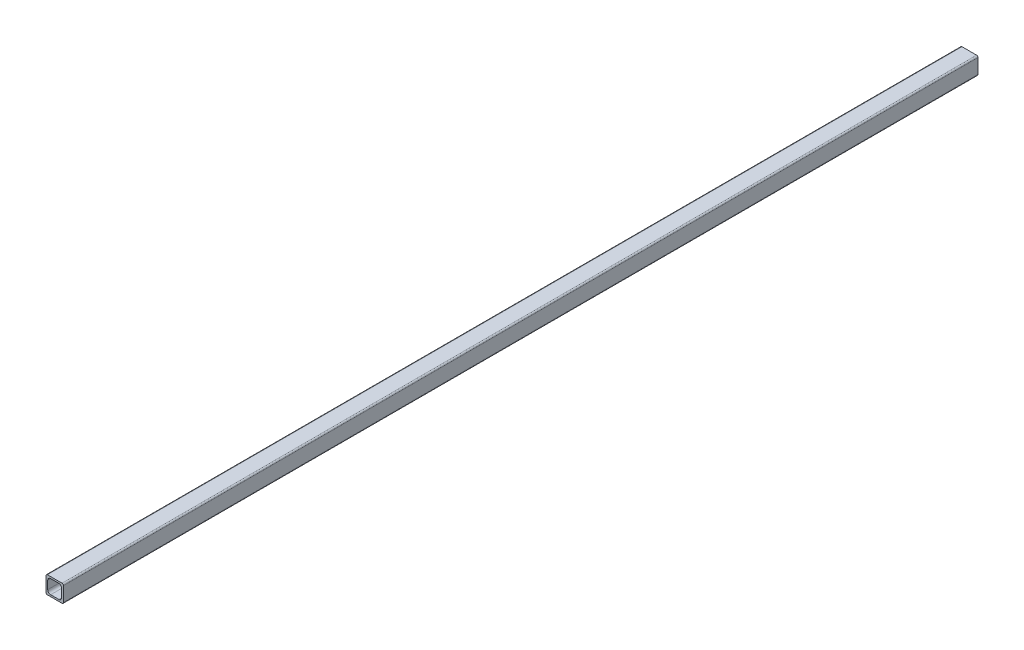
ISO-10303-21;
HEADER;
FILE_DESCRIPTION(('STEP AP214'),'2;1');
FILE_NAME('part.step','',(''),(''),'','','');
FILE_SCHEMA(('AUTOMOTIVE_DESIGN { 1 0 10303 214 1 1 1 1 }'));
ENDSEC;
DATA;
#1=APPLICATION_CONTEXT('core data for automotive mechanical design processes');
#2=APPLICATION_PROTOCOL_DEFINITION('international standard','automotive_design',2000,#1);
#3=PRODUCT_CONTEXT('',#1,'mechanical');
#4=PRODUCT('Part','Part','',(#3));
#5=PRODUCT_RELATED_PRODUCT_CATEGORY('part','',(#4));
#6=PRODUCT_DEFINITION_FORMATION('','',#4);
#7=PRODUCT_DEFINITION_CONTEXT('part definition',#1,'design');
#8=PRODUCT_DEFINITION('design','',#6,#7);
#9=PRODUCT_DEFINITION_SHAPE('','',#8);
#10=(LENGTH_UNIT() NAMED_UNIT(*) SI_UNIT(.MILLI.,.METRE.));
#11=(NAMED_UNIT(*) PLANE_ANGLE_UNIT() SI_UNIT($,.RADIAN.));
#12=(NAMED_UNIT(*) SI_UNIT($,.STERADIAN.) SOLID_ANGLE_UNIT());
#13=UNCERTAINTY_MEASURE_WITH_UNIT(LENGTH_MEASURE(1.E-05),#10,'distance_accuracy_value','');
#14=(GEOMETRIC_REPRESENTATION_CONTEXT(3) GLOBAL_UNCERTAINTY_ASSIGNED_CONTEXT((#13)) GLOBAL_UNIT_ASSIGNED_CONTEXT((#10,
#11,#12)) REPRESENTATION_CONTEXT('',''));
#15=CARTESIAN_POINT('',(0.,0.,0.));
#16=DIRECTION('',(0.,0.,1.));
#17=DIRECTION('',(1.,0.,0.));
#18=AXIS2_PLACEMENT_3D('',#15,#16,#17);
#19=CARTESIAN_POINT('',(1.524,1.524,-1000.125));
#20=DIRECTION('',(0.,0.,1.));
#21=DIRECTION('',(1.,0.,0.));
#22=AXIS2_PLACEMENT_3D('',#19,#20,#21);
#23=CYLINDRICAL_SURFACE('',#22,1.524);
#24=CARTESIAN_POINT('',(1.524,1.524,0.));
#25=DIRECTION('',(0.,0.,1.));
#26=DIRECTION('',(1.,0.,0.));
#27=AXIS2_PLACEMENT_3D('',#24,#25,#26);
#28=CIRCLE('',#27,1.524);
#29=CARTESIAN_POINT('',(0.,1.52400000000001,0.));
#30=VERTEX_POINT('',#29);
#31=CARTESIAN_POINT('',(1.52400000000001,0.,0.));
#32=VERTEX_POINT('',#31);
#33=EDGE_CURVE('E213',#30,#32,#28,.T.);
#34=ORIENTED_EDGE('',*,*,#33,.F.);
#35=DIRECTION('',(0.,0.,1.));
#36=VECTOR('',#35,1.);
#37=CARTESIAN_POINT('',(0.,1.52400000000001,-1000.125));
#38=LINE('',#37,#36);
#39=CARTESIAN_POINT('',(0.,1.52400000000001,-1000.125));
#40=VERTEX_POINT('',#39);
#41=EDGE_CURVE('E11',#40,#30,#38,.T.);
#42=ORIENTED_EDGE('',*,*,#41,.F.);
#43=CARTESIAN_POINT('',(1.524,1.524,-1000.125));
#44=DIRECTION('',(0.,0.,1.));
#45=DIRECTION('',(1.,0.,0.));
#46=AXIS2_PLACEMENT_3D('',#43,#44,#45);
#47=CIRCLE('',#46,1.524);
#48=CARTESIAN_POINT('',(1.52400000000001,0.,-1000.125));
#49=VERTEX_POINT('',#48);
#50=EDGE_CURVE('E225',#40,#49,#47,.T.);
#51=ORIENTED_EDGE('',*,*,#50,.T.);
#52=DIRECTION('',(0.,0.,1.));
#53=VECTOR('',#52,1.);
#54=CARTESIAN_POINT('',(1.52400000000001,0.,-1000.125));
#55=LINE('',#54,#53);
#56=EDGE_CURVE('E46',#49,#32,#55,.T.);
#57=ORIENTED_EDGE('',*,*,#56,.T.);
#58=EDGE_LOOP('',(#34,#42,#51,#57));
#59=FACE_BOUND('',#58,.T.);
#60=ADVANCED_FACE('F43',(#59),#23,.T.);
#61=CARTESIAN_POINT('',(0.,1.52400000000001,-1000.125));
#62=DIRECTION('',(-1.,0.,0.));
#63=DIRECTION('',(0.,0.,1.));
#64=AXIS2_PLACEMENT_3D('',#61,#62,#63);
#65=PLANE('',#64);
#66=DIRECTION('',(0.,-1.,0.));
#67=VECTOR('',#66,1.);
#68=CARTESIAN_POINT('',(0.,1.52400000000001,0.));
#69=LINE('',#68,#67);
#70=CARTESIAN_POINT('',(0.,17.526,0.));
#71=VERTEX_POINT('',#70);
#72=EDGE_CURVE('E229',#71,#30,#69,.T.);
#73=ORIENTED_EDGE('',*,*,#72,.F.);
#74=DIRECTION('',(0.,0.,1.));
#75=VECTOR('',#74,1.);
#76=CARTESIAN_POINT('',(0.,17.526,-1000.125));
#77=LINE('',#76,#75);
#78=CARTESIAN_POINT('',(0.,17.526,-1000.125));
#79=VERTEX_POINT('',#78);
#80=EDGE_CURVE('E51',#79,#71,#77,.T.);
#81=ORIENTED_EDGE('',*,*,#80,.F.);
#82=DIRECTION('',(0.,-1.,0.));
#83=VECTOR('',#82,1.);
#84=CARTESIAN_POINT('',(0.,1.52400000000001,-1000.125));
#85=LINE('',#84,#83);
#86=EDGE_CURVE('E247',#79,#40,#85,.T.);
#87=ORIENTED_EDGE('',*,*,#86,.T.);
#88=ORIENTED_EDGE('',*,*,#41,.T.);
#89=EDGE_LOOP('',(#73,#81,#87,#88));
#90=FACE_BOUND('',#89,.T.);
#91=ADVANCED_FACE('F294',(#90),#65,.T.);
#92=CARTESIAN_POINT('',(1.524,17.526,-1000.125));
#93=DIRECTION('',(0.,0.,1.));
#94=DIRECTION('',(1.,0.,0.));
#95=AXIS2_PLACEMENT_3D('',#92,#93,#94);
#96=CYLINDRICAL_SURFACE('',#95,1.524);
#97=CARTESIAN_POINT('',(1.524,17.526,0.));
#98=DIRECTION('',(0.,0.,1.));
#99=DIRECTION('',(-1.,0.,0.));
#100=AXIS2_PLACEMENT_3D('',#97,#98,#99);
#101=CIRCLE('',#100,1.524);
#102=CARTESIAN_POINT('',(1.52400000000001,19.05,0.));
#103=VERTEX_POINT('',#102);
#104=EDGE_CURVE('E267',#103,#71,#101,.T.);
#105=ORIENTED_EDGE('',*,*,#104,.F.);
#106=DIRECTION('',(0.,0.,1.));
#107=VECTOR('',#106,1.);
#108=CARTESIAN_POINT('',(1.52400000000001,19.05,-1000.125));
#109=LINE('',#108,#107);
#110=CARTESIAN_POINT('',(1.52400000000001,19.05,-1000.125));
#111=VERTEX_POINT('',#110);
#112=EDGE_CURVE('E273',#111,#103,#109,.T.);
#113=ORIENTED_EDGE('',*,*,#112,.F.);
#114=CARTESIAN_POINT('',(1.524,17.526,-1000.125));
#115=DIRECTION('',(0.,0.,1.));
#116=DIRECTION('',(-1.,0.,0.));
#117=AXIS2_PLACEMENT_3D('',#114,#115,#116);
#118=CIRCLE('',#117,1.524);
#119=EDGE_CURVE('E244',#111,#79,#118,.T.);
#120=ORIENTED_EDGE('',*,*,#119,.T.);
#121=ORIENTED_EDGE('',*,*,#80,.T.);
#122=EDGE_LOOP('',(#105,#113,#120,#121));
#123=FACE_BOUND('',#122,.T.);
#124=ADVANCED_FACE('F313',(#123),#96,.T.);
#125=CARTESIAN_POINT('',(1.52400000000001,19.05,-1000.125));
#126=DIRECTION('',(0.,1.,0.));
#127=DIRECTION('',(0.,0.,1.));
#128=AXIS2_PLACEMENT_3D('',#125,#126,#127);
#129=PLANE('',#128);
#130=DIRECTION('',(-1.,0.,0.));
#131=VECTOR('',#130,1.);
#132=CARTESIAN_POINT('',(1.52400000000001,19.05,0.));
#133=LINE('',#132,#131);
#134=CARTESIAN_POINT('',(17.526,19.05,0.));
#135=VERTEX_POINT('',#134);
#136=EDGE_CURVE('E264',#135,#103,#133,.T.);
#137=ORIENTED_EDGE('',*,*,#136,.F.);
#138=DIRECTION('',(0.,0.,1.));
#139=VECTOR('',#138,1.);
#140=CARTESIAN_POINT('',(17.526,19.05,-1000.125));
#141=LINE('',#140,#139);
#142=CARTESIAN_POINT('',(17.526,19.05,-1000.125));
#143=VERTEX_POINT('',#142);
#144=EDGE_CURVE('E275',#143,#135,#141,.T.);
#145=ORIENTED_EDGE('',*,*,#144,.F.);
#146=DIRECTION('',(-1.,0.,0.));
#147=VECTOR('',#146,1.);
#148=CARTESIAN_POINT('',(1.52400000000001,19.05,-1000.125));
#149=LINE('',#148,#147);
#150=EDGE_CURVE('E241',#143,#111,#149,.T.);
#151=ORIENTED_EDGE('',*,*,#150,.T.);
#152=ORIENTED_EDGE('',*,*,#112,.T.);
#153=EDGE_LOOP('',(#137,#145,#151,#152));
#154=FACE_BOUND('',#153,.T.);
#155=ADVANCED_FACE('F311',(#154),#129,.T.);
#156=CARTESIAN_POINT('',(17.526,17.526,-1000.125));
#157=DIRECTION('',(0.,0.,1.));
#158=DIRECTION('',(1.,0.,0.));
#159=AXIS2_PLACEMENT_3D('',#156,#157,#158);
#160=CYLINDRICAL_SURFACE('',#159,1.524);
#161=CARTESIAN_POINT('',(17.526,17.526,0.));
#162=DIRECTION('',(0.,0.,1.));
#163=DIRECTION('',(1.,0.,0.));
#164=AXIS2_PLACEMENT_3D('',#161,#162,#163);
#165=CIRCLE('',#164,1.524);
#166=CARTESIAN_POINT('',(19.05,17.526,0.));
#167=VERTEX_POINT('',#166);
#168=EDGE_CURVE('E261',#167,#135,#165,.T.);
#169=ORIENTED_EDGE('',*,*,#168,.F.);
#170=DIRECTION('',(0.,0.,1.));
#171=VECTOR('',#170,1.);
#172=CARTESIAN_POINT('',(19.05,17.526,-1000.125));
#173=LINE('',#172,#171);
#174=CARTESIAN_POINT('',(19.05,17.526,-1000.125));
#175=VERTEX_POINT('',#174);
#176=EDGE_CURVE('E277',#175,#167,#173,.T.);
#177=ORIENTED_EDGE('',*,*,#176,.F.);
#178=CARTESIAN_POINT('',(17.526,17.526,-1000.125));
#179=DIRECTION('',(0.,0.,1.));
#180=DIRECTION('',(1.,0.,0.));
#181=AXIS2_PLACEMENT_3D('',#178,#179,#180);
#182=CIRCLE('',#181,1.524);
#183=EDGE_CURVE('E238',#175,#143,#182,.T.);
#184=ORIENTED_EDGE('',*,*,#183,.T.);
#185=ORIENTED_EDGE('',*,*,#144,.T.);
#186=EDGE_LOOP('',(#169,#177,#184,#185));
#187=FACE_BOUND('',#186,.T.);
#188=ADVANCED_FACE('F307',(#187),#160,.T.);
#189=CARTESIAN_POINT('',(19.05,1.52400000000001,-1000.125));
#190=DIRECTION('',(1.,0.,0.));
#191=DIRECTION('',(0.,0.,-1.));
#192=AXIS2_PLACEMENT_3D('',#189,#190,#191);
#193=PLANE('',#192);
#194=DIRECTION('',(0.,1.,0.));
#195=VECTOR('',#194,1.);
#196=CARTESIAN_POINT('',(19.05,1.52400000000001,0.));
#197=LINE('',#196,#195);
#198=CARTESIAN_POINT('',(19.05,1.52400000000001,0.));
#199=VERTEX_POINT('',#198);
#200=EDGE_CURVE('E258',#199,#167,#197,.T.);
#201=ORIENTED_EDGE('',*,*,#200,.F.);
#202=DIRECTION('',(0.,0.,1.));
#203=VECTOR('',#202,1.);
#204=CARTESIAN_POINT('',(19.05,1.52400000000001,-1000.125));
#205=LINE('',#204,#203);
#206=CARTESIAN_POINT('',(19.05,1.52400000000001,-1000.125));
#207=VERTEX_POINT('',#206);
#208=EDGE_CURVE('E279',#207,#199,#205,.T.);
#209=ORIENTED_EDGE('',*,*,#208,.F.);
#210=DIRECTION('',(0.,1.,0.));
#211=VECTOR('',#210,1.);
#212=CARTESIAN_POINT('',(19.05,1.52400000000001,-1000.125));
#213=LINE('',#212,#211);
#214=EDGE_CURVE('E235',#207,#175,#213,.T.);
#215=ORIENTED_EDGE('',*,*,#214,.T.);
#216=ORIENTED_EDGE('',*,*,#176,.T.);
#217=EDGE_LOOP('',(#201,#209,#215,#216));
#218=FACE_BOUND('',#217,.T.);
#219=ADVANCED_FACE('F305',(#218),#193,.T.);
#220=CARTESIAN_POINT('',(17.526,1.524,-1000.125));
#221=DIRECTION('',(0.,0.,1.));
#222=DIRECTION('',(1.,0.,0.));
#223=AXIS2_PLACEMENT_3D('',#220,#221,#222);
#224=CYLINDRICAL_SURFACE('',#223,1.524);
#225=CARTESIAN_POINT('',(17.526,1.524,0.));
#226=DIRECTION('',(0.,0.,1.));
#227=DIRECTION('',(1.,0.,0.));
#228=AXIS2_PLACEMENT_3D('',#225,#226,#227);
#229=CIRCLE('',#228,1.524);
#230=CARTESIAN_POINT('',(17.526,0.,0.));
#231=VERTEX_POINT('',#230);
#232=EDGE_CURVE('E255',#231,#199,#229,.T.);
#233=ORIENTED_EDGE('',*,*,#232,.F.);
#234=DIRECTION('',(0.,0.,1.));
#235=VECTOR('',#234,1.);
#236=CARTESIAN_POINT('',(17.526,0.,-1000.125));
#237=LINE('',#236,#235);
#238=CARTESIAN_POINT('',(17.526,0.,-1000.125));
#239=VERTEX_POINT('',#238);
#240=EDGE_CURVE('E280',#239,#231,#237,.T.);
#241=ORIENTED_EDGE('',*,*,#240,.F.);
#242=CARTESIAN_POINT('',(17.526,1.524,-1000.125));
#243=DIRECTION('',(0.,0.,1.));
#244=DIRECTION('',(1.,0.,0.));
#245=AXIS2_PLACEMENT_3D('',#242,#243,#244);
#246=CIRCLE('',#245,1.524);
#247=EDGE_CURVE('E232',#239,#207,#246,.T.);
#248=ORIENTED_EDGE('',*,*,#247,.T.);
#249=ORIENTED_EDGE('',*,*,#208,.T.);
#250=EDGE_LOOP('',(#233,#241,#248,#249));
#251=FACE_BOUND('',#250,.T.);
#252=ADVANCED_FACE('F301',(#251),#224,.T.);
#253=CARTESIAN_POINT('',(1.52400000000001,0.,-1000.125));
#254=DIRECTION('',(0.,-1.,0.));
#255=DIRECTION('',(0.,0.,-1.));
#256=AXIS2_PLACEMENT_3D('',#253,#254,#255);
#257=PLANE('',#256);
#258=DIRECTION('',(1.,0.,0.));
#259=VECTOR('',#258,1.);
#260=CARTESIAN_POINT('',(1.52400000000001,0.,0.));
#261=LINE('',#260,#259);
#262=EDGE_CURVE('E252',#32,#231,#261,.T.);
#263=ORIENTED_EDGE('',*,*,#262,.F.);
#264=ORIENTED_EDGE('',*,*,#56,.F.);
#265=DIRECTION('',(1.,0.,0.));
#266=VECTOR('',#265,1.);
#267=CARTESIAN_POINT('',(1.52400000000001,0.,-1000.125));
#268=LINE('',#267,#266);
#269=EDGE_CURVE('E228',#49,#239,#268,.T.);
#270=ORIENTED_EDGE('',*,*,#269,.T.);
#271=ORIENTED_EDGE('',*,*,#240,.T.);
#272=EDGE_LOOP('',(#263,#264,#270,#271));
#273=FACE_BOUND('',#272,.T.);
#274=ADVANCED_FACE('F288',(#273),#257,.T.);
#275=CARTESIAN_POINT('',(1.524,1.524,-1000.125));
#276=DIRECTION('',(0.,0.,1.));
#277=DIRECTION('',(1.,0.,0.));
#278=AXIS2_PLACEMENT_3D('',#275,#276,#277);
#279=PLANE('',#278);
#280=DIRECTION('',(0.,1.,0.));
#281=VECTOR('',#280,1.);
#282=CARTESIAN_POINT('',(17.145,13.97,-1000.125));
#283=LINE('',#282,#281);
#284=CARTESIAN_POINT('',(17.145,5.08000000000002,-1000.125));
#285=VERTEX_POINT('',#284);
#286=CARTESIAN_POINT('',(17.145,13.97,-1000.125));
#287=VERTEX_POINT('',#286);
#288=EDGE_CURVE('E164',#285,#287,#283,.T.);
#289=ORIENTED_EDGE('',*,*,#288,.T.);
#290=CARTESIAN_POINT('',(13.97,13.97,-1000.125));
#291=DIRECTION('',(0.,0.,1.));
#292=DIRECTION('',(-1.,0.,0.));
#293=AXIS2_PLACEMENT_3D('',#290,#291,#292);
#294=CIRCLE('',#293,3.175);
#295=CARTESIAN_POINT('',(13.97,17.145,-1000.125));
#296=VERTEX_POINT('',#295);
#297=EDGE_CURVE('E158',#287,#296,#294,.T.);
#298=ORIENTED_EDGE('',*,*,#297,.T.);
#299=DIRECTION('',(-1.,0.,0.));
#300=VECTOR('',#299,1.);
#301=CARTESIAN_POINT('',(5.08000000000003,17.145,-1000.125));
#302=LINE('',#301,#300);
#303=CARTESIAN_POINT('',(5.08000000000003,17.145,-1000.125));
#304=VERTEX_POINT('',#303);
#305=EDGE_CURVE('E167',#296,#304,#302,.T.);
#306=ORIENTED_EDGE('',*,*,#305,.T.);
#307=CARTESIAN_POINT('',(5.08000000000001,13.97,-1000.125));
#308=DIRECTION('',(0.,0.,1.));
#309=DIRECTION('',(-1.,0.,0.));
#310=AXIS2_PLACEMENT_3D('',#307,#308,#309);
#311=CIRCLE('',#310,3.175);
#312=CARTESIAN_POINT('',(1.90500000000001,13.97,-1000.125));
#313=VERTEX_POINT('',#312);
#314=EDGE_CURVE('E59',#304,#313,#311,.T.);
#315=ORIENTED_EDGE('',*,*,#314,.T.);
#316=DIRECTION('',(0.,-1.,0.));
#317=VECTOR('',#316,1.);
#318=CARTESIAN_POINT('',(1.90500000000001,13.97,-1000.125));
#319=LINE('',#318,#317);
#320=CARTESIAN_POINT('',(1.90500000000001,5.08000000000002,-1000.125));
#321=VERTEX_POINT('',#320);
#322=EDGE_CURVE('E182',#313,#321,#319,.T.);
#323=ORIENTED_EDGE('',*,*,#322,.T.);
#324=CARTESIAN_POINT('',(5.08000000000001,5.08,-1000.125));
#325=DIRECTION('',(0.,0.,1.));
#326=DIRECTION('',(-1.,0.,0.));
#327=AXIS2_PLACEMENT_3D('',#324,#325,#326);
#328=CIRCLE('',#327,3.175);
#329=CARTESIAN_POINT('',(5.08000000000003,1.905,-1000.125));
#330=VERTEX_POINT('',#329);
#331=EDGE_CURVE('E185',#321,#330,#328,.T.);
#332=ORIENTED_EDGE('',*,*,#331,.T.);
#333=DIRECTION('',(1.,0.,0.));
#334=VECTOR('',#333,1.);
#335=CARTESIAN_POINT('',(5.08000000000003,1.905,-1000.125));
#336=LINE('',#335,#334);
#337=CARTESIAN_POINT('',(13.97,1.905,-1000.125));
#338=VERTEX_POINT('',#337);
#339=EDGE_CURVE('E188',#330,#338,#336,.T.);
#340=ORIENTED_EDGE('',*,*,#339,.T.);
#341=CARTESIAN_POINT('',(13.97,5.08,-1000.125));
#342=DIRECTION('',(0.,0.,1.));
#343=DIRECTION('',(-1.,0.,0.));
#344=AXIS2_PLACEMENT_3D('',#341,#342,#343);
#345=CIRCLE('',#344,3.175);
#346=EDGE_CURVE('E191',#338,#285,#345,.T.);
#347=ORIENTED_EDGE('',*,*,#346,.T.);
#348=EDGE_LOOP('',(#289,#298,#306,#315,#323,#332,#340,#347));
#349=FACE_BOUND('',#348,.T.);
#350=ORIENTED_EDGE('',*,*,#50,.F.);
#351=ORIENTED_EDGE('',*,*,#86,.F.);
#352=ORIENTED_EDGE('',*,*,#119,.F.);
#353=ORIENTED_EDGE('',*,*,#150,.F.);
#354=ORIENTED_EDGE('',*,*,#183,.F.);
#355=ORIENTED_EDGE('',*,*,#214,.F.);
#356=ORIENTED_EDGE('',*,*,#247,.F.);
#357=ORIENTED_EDGE('',*,*,#269,.F.);
#358=EDGE_LOOP('',(#350,#351,#352,#353,#354,#355,#356,#357));
#359=FACE_BOUND('',#358,.T.);
#360=ADVANCED_FACE('F171',(#349,#359),#279,.F.);
#361=CARTESIAN_POINT('',(1.524,1.524,0.));
#362=DIRECTION('',(0.,0.,1.));
#363=DIRECTION('',(1.,0.,0.));
#364=AXIS2_PLACEMENT_3D('',#361,#362,#363);
#365=PLANE('',#364);
#366=CARTESIAN_POINT('',(13.97,13.97,0.));
#367=DIRECTION('',(0.,0.,1.));
#368=DIRECTION('',(-1.,0.,0.));
#369=AXIS2_PLACEMENT_3D('',#366,#367,#368);
#370=CIRCLE('',#369,3.175);
#371=CARTESIAN_POINT('',(17.145,13.97,0.));
#372=VERTEX_POINT('',#371);
#373=CARTESIAN_POINT('',(13.97,17.145,0.));
#374=VERTEX_POINT('',#373);
#375=EDGE_CURVE('E67',#372,#374,#370,.T.);
#376=ORIENTED_EDGE('',*,*,#375,.F.);
#377=DIRECTION('',(0.,1.,0.));
#378=VECTOR('',#377,1.);
#379=CARTESIAN_POINT('',(17.145,13.97,0.));
#380=LINE('',#379,#378);
#381=CARTESIAN_POINT('',(17.145,5.08000000000002,0.));
#382=VERTEX_POINT('',#381);
#383=EDGE_CURVE('E175',#382,#372,#380,.T.);
#384=ORIENTED_EDGE('',*,*,#383,.F.);
#385=CARTESIAN_POINT('',(13.97,5.08,0.));
#386=DIRECTION('',(0.,0.,1.));
#387=DIRECTION('',(-1.,0.,0.));
#388=AXIS2_PLACEMENT_3D('',#385,#386,#387);
#389=CIRCLE('',#388,3.175);
#390=CARTESIAN_POINT('',(13.97,1.905,0.));
#391=VERTEX_POINT('',#390);
#392=EDGE_CURVE('E178',#391,#382,#389,.T.);
#393=ORIENTED_EDGE('',*,*,#392,.F.);
#394=DIRECTION('',(1.,0.,0.));
#395=VECTOR('',#394,1.);
#396=CARTESIAN_POINT('',(5.08000000000003,1.905,0.));
#397=LINE('',#396,#395);
#398=CARTESIAN_POINT('',(5.08000000000003,1.905,0.));
#399=VERTEX_POINT('',#398);
#400=EDGE_CURVE('E206',#399,#391,#397,.T.);
#401=ORIENTED_EDGE('',*,*,#400,.F.);
#402=CARTESIAN_POINT('',(5.08000000000001,5.08,0.));
#403=DIRECTION('',(0.,0.,1.));
#404=DIRECTION('',(-1.,0.,0.));
#405=AXIS2_PLACEMENT_3D('',#402,#403,#404);
#406=CIRCLE('',#405,3.175);
#407=CARTESIAN_POINT('',(1.90500000000001,5.08000000000002,0.));
#408=VERTEX_POINT('',#407);
#409=EDGE_CURVE('E203',#408,#399,#406,.T.);
#410=ORIENTED_EDGE('',*,*,#409,.F.);
#411=DIRECTION('',(0.,-1.,0.));
#412=VECTOR('',#411,1.);
#413=CARTESIAN_POINT('',(1.90500000000001,13.97,0.));
#414=LINE('',#413,#412);
#415=CARTESIAN_POINT('',(1.90500000000001,13.97,0.));
#416=VERTEX_POINT('',#415);
#417=EDGE_CURVE('E200',#416,#408,#414,.T.);
#418=ORIENTED_EDGE('',*,*,#417,.F.);
#419=CARTESIAN_POINT('',(5.08000000000001,13.97,0.));
#420=DIRECTION('',(0.,0.,1.));
#421=DIRECTION('',(-1.,0.,0.));
#422=AXIS2_PLACEMENT_3D('',#419,#420,#421);
#423=CIRCLE('',#422,3.175);
#424=CARTESIAN_POINT('',(5.08000000000003,17.145,0.));
#425=VERTEX_POINT('',#424);
#426=EDGE_CURVE('E197',#425,#416,#423,.T.);
#427=ORIENTED_EDGE('',*,*,#426,.F.);
#428=DIRECTION('',(-1.,0.,0.));
#429=VECTOR('',#428,1.);
#430=CARTESIAN_POINT('',(5.08000000000003,17.145,0.));
#431=LINE('',#430,#429);
#432=EDGE_CURVE('E195',#374,#425,#431,.T.);
#433=ORIENTED_EDGE('',*,*,#432,.F.);
#434=EDGE_LOOP('',(#376,#384,#393,#401,#410,#418,#427,#433));
#435=FACE_BOUND('',#434,.T.);
#436=ORIENTED_EDGE('',*,*,#33,.T.);
#437=ORIENTED_EDGE('',*,*,#262,.T.);
#438=ORIENTED_EDGE('',*,*,#232,.T.);
#439=ORIENTED_EDGE('',*,*,#200,.T.);
#440=ORIENTED_EDGE('',*,*,#168,.T.);
#441=ORIENTED_EDGE('',*,*,#136,.T.);
#442=ORIENTED_EDGE('',*,*,#104,.T.);
#443=ORIENTED_EDGE('',*,*,#72,.T.);
#444=EDGE_LOOP('',(#436,#437,#438,#439,#440,#441,#442,#443));
#445=FACE_BOUND('',#444,.T.);
#446=ADVANCED_FACE('F290',(#435,#445),#365,.T.);
#447=CARTESIAN_POINT('',(13.97,13.97,-1000.125));
#448=DIRECTION('',(0.,0.,1.));
#449=DIRECTION('',(1.,0.,0.));
#450=AXIS2_PLACEMENT_3D('',#447,#448,#449);
#451=CYLINDRICAL_SURFACE('',#450,3.175);
#452=ORIENTED_EDGE('',*,*,#375,.T.);
#453=DIRECTION('',(0.,0.,1.));
#454=VECTOR('',#453,1.);
#455=CARTESIAN_POINT('',(13.97,17.145,-1000.125));
#456=LINE('',#455,#454);
#457=EDGE_CURVE('E154',#296,#374,#456,.T.);
#458=ORIENTED_EDGE('',*,*,#457,.F.);
#459=ORIENTED_EDGE('',*,*,#297,.F.);
#460=DIRECTION('',(0.,0.,1.));
#461=VECTOR('',#460,1.);
#462=CARTESIAN_POINT('',(17.145,13.97,-1000.125));
#463=LINE('',#462,#461);
#464=EDGE_CURVE('E211',#287,#372,#463,.T.);
#465=ORIENTED_EDGE('',*,*,#464,.T.);
#466=EDGE_LOOP('',(#452,#458,#459,#465));
#467=FACE_BOUND('',#466,.T.);
#468=ADVANCED_FACE('F156',(#467),#451,.F.);
#469=CARTESIAN_POINT('',(17.145,13.97,-1000.125));
#470=DIRECTION('',(1.,0.,0.));
#471=DIRECTION('',(0.,1.,0.));
#472=AXIS2_PLACEMENT_3D('',#469,#470,#471);
#473=PLANE('',#472);
#474=ORIENTED_EDGE('',*,*,#383,.T.);
#475=ORIENTED_EDGE('',*,*,#464,.F.);
#476=ORIENTED_EDGE('',*,*,#288,.F.);
#477=DIRECTION('',(0.,0.,1.));
#478=VECTOR('',#477,1.);
#479=CARTESIAN_POINT('',(17.145,5.08000000000002,-1000.125));
#480=LINE('',#479,#478);
#481=EDGE_CURVE('E214',#285,#382,#480,.T.);
#482=ORIENTED_EDGE('',*,*,#481,.T.);
#483=EDGE_LOOP('',(#474,#475,#476,#482));
#484=FACE_BOUND('',#483,.T.);
#485=ADVANCED_FACE('F398',(#484),#473,.F.);
#486=CARTESIAN_POINT('',(13.97,5.08,-1000.125));
#487=DIRECTION('',(0.,0.,1.));
#488=DIRECTION('',(1.,0.,0.));
#489=AXIS2_PLACEMENT_3D('',#486,#487,#488);
#490=CYLINDRICAL_SURFACE('',#489,3.175);
#491=ORIENTED_EDGE('',*,*,#392,.T.);
#492=ORIENTED_EDGE('',*,*,#481,.F.);
#493=ORIENTED_EDGE('',*,*,#346,.F.);
#494=DIRECTION('',(0.,0.,1.));
#495=VECTOR('',#494,1.);
#496=CARTESIAN_POINT('',(13.97,1.905,-1000.125));
#497=LINE('',#496,#495);
#498=EDGE_CURVE('E216',#338,#391,#497,.T.);
#499=ORIENTED_EDGE('',*,*,#498,.T.);
#500=EDGE_LOOP('',(#491,#492,#493,#499));
#501=FACE_BOUND('',#500,.T.);
#502=ADVANCED_FACE('F407',(#501),#490,.F.);
#503=CARTESIAN_POINT('',(5.08000000000003,1.905,-1000.125));
#504=DIRECTION('',(0.,-1.,0.));
#505=DIRECTION('',(0.,0.,-1.));
#506=AXIS2_PLACEMENT_3D('',#503,#504,#505);
#507=PLANE('',#506);
#508=ORIENTED_EDGE('',*,*,#400,.T.);
#509=ORIENTED_EDGE('',*,*,#498,.F.);
#510=ORIENTED_EDGE('',*,*,#339,.F.);
#511=DIRECTION('',(0.,0.,1.));
#512=VECTOR('',#511,1.);
#513=CARTESIAN_POINT('',(5.08000000000003,1.905,-1000.125));
#514=LINE('',#513,#512);
#515=EDGE_CURVE('E218',#330,#399,#514,.T.);
#516=ORIENTED_EDGE('',*,*,#515,.T.);
#517=EDGE_LOOP('',(#508,#509,#510,#516));
#518=FACE_BOUND('',#517,.T.);
#519=ADVANCED_FACE('F417',(#518),#507,.F.);
#520=CARTESIAN_POINT('',(5.08000000000001,5.08,-1000.125));
#521=DIRECTION('',(0.,0.,1.));
#522=DIRECTION('',(1.,0.,0.));
#523=AXIS2_PLACEMENT_3D('',#520,#521,#522);
#524=CYLINDRICAL_SURFACE('',#523,3.175);
#525=ORIENTED_EDGE('',*,*,#409,.T.);
#526=ORIENTED_EDGE('',*,*,#515,.F.);
#527=ORIENTED_EDGE('',*,*,#331,.F.);
#528=DIRECTION('',(0.,0.,1.));
#529=VECTOR('',#528,1.);
#530=CARTESIAN_POINT('',(1.90500000000001,5.08000000000002,-1000.125));
#531=LINE('',#530,#529);
#532=EDGE_CURVE('E220',#321,#408,#531,.T.);
#533=ORIENTED_EDGE('',*,*,#532,.T.);
#534=EDGE_LOOP('',(#525,#526,#527,#533));
#535=FACE_BOUND('',#534,.T.);
#536=ADVANCED_FACE('F427',(#535),#524,.F.);
#537=CARTESIAN_POINT('',(1.90500000000001,13.97,-1000.125));
#538=DIRECTION('',(-1.,0.,0.));
#539=DIRECTION('',(0.,-1.,0.));
#540=AXIS2_PLACEMENT_3D('',#537,#538,#539);
#541=PLANE('',#540);
#542=ORIENTED_EDGE('',*,*,#417,.T.);
#543=ORIENTED_EDGE('',*,*,#532,.F.);
#544=ORIENTED_EDGE('',*,*,#322,.F.);
#545=DIRECTION('',(0.,0.,1.));
#546=VECTOR('',#545,1.);
#547=CARTESIAN_POINT('',(1.90500000000001,13.97,-1000.125));
#548=LINE('',#547,#546);
#549=EDGE_CURVE('E222',#313,#416,#548,.T.);
#550=ORIENTED_EDGE('',*,*,#549,.T.);
#551=EDGE_LOOP('',(#542,#543,#544,#550));
#552=FACE_BOUND('',#551,.T.);
#553=ADVANCED_FACE('F437',(#552),#541,.F.);
#554=CARTESIAN_POINT('',(5.08000000000001,13.97,-1000.125));
#555=DIRECTION('',(0.,0.,1.));
#556=DIRECTION('',(1.,0.,0.));
#557=AXIS2_PLACEMENT_3D('',#554,#555,#556);
#558=CYLINDRICAL_SURFACE('',#557,3.175);
#559=ORIENTED_EDGE('',*,*,#426,.T.);
#560=ORIENTED_EDGE('',*,*,#549,.F.);
#561=ORIENTED_EDGE('',*,*,#314,.F.);
#562=DIRECTION('',(0.,0.,1.));
#563=VECTOR('',#562,1.);
#564=CARTESIAN_POINT('',(5.08000000000003,17.145,-1000.125));
#565=LINE('',#564,#563);
#566=EDGE_CURVE('E163',#304,#425,#565,.T.);
#567=ORIENTED_EDGE('',*,*,#566,.T.);
#568=EDGE_LOOP('',(#559,#560,#561,#567));
#569=FACE_BOUND('',#568,.T.);
#570=ADVANCED_FACE('F447',(#569),#558,.F.);
#571=CARTESIAN_POINT('',(5.08000000000003,17.145,-1000.125));
#572=DIRECTION('',(0.,1.,0.));
#573=DIRECTION('',(0.,0.,1.));
#574=AXIS2_PLACEMENT_3D('',#571,#572,#573);
#575=PLANE('',#574);
#576=ORIENTED_EDGE('',*,*,#432,.T.);
#577=ORIENTED_EDGE('',*,*,#566,.F.);
#578=ORIENTED_EDGE('',*,*,#305,.F.);
#579=ORIENTED_EDGE('',*,*,#457,.T.);
#580=EDGE_LOOP('',(#576,#577,#578,#579));
#581=FACE_BOUND('',#580,.T.);
#582=ADVANCED_FACE('F168',(#581),#575,.F.);
#583=CLOSED_SHELL('',(#60,#91,#124,#155,#188,#219,#252,#274,#360,#446,#468,#485,#502,#519,#536,
#553,#570,#582));
#584=MANIFOLD_SOLID_BREP('B2',#583);
#585=ADVANCED_BREP_SHAPE_REPRESENTATION('',(#18,#584),#14);
#586=SHAPE_DEFINITION_REPRESENTATION(#9,#585);
ENDSEC;
END-ISO-10303-21;
